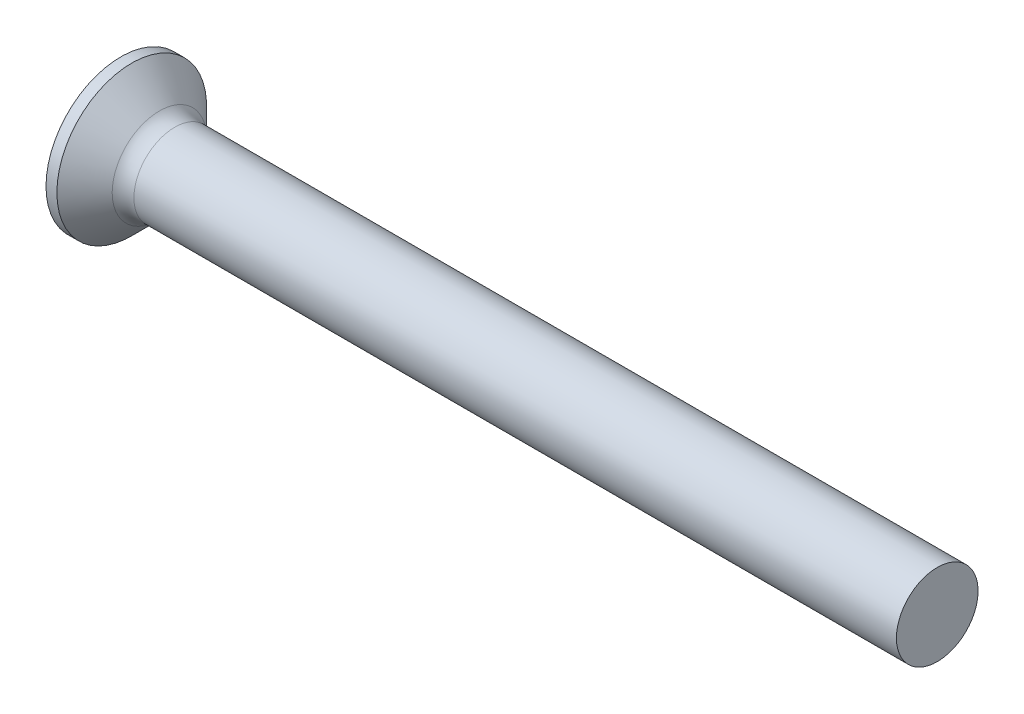
ISO-10303-21;
HEADER;
FILE_DESCRIPTION(('STEP AP214'),'2;1');
FILE_NAME('part.step','',(''),(''),'','','');
FILE_SCHEMA(('AUTOMOTIVE_DESIGN { 1 0 10303 214 1 1 1 1 }'));
ENDSEC;
DATA;
#1=APPLICATION_CONTEXT('core data for automotive mechanical design processes');
#2=APPLICATION_PROTOCOL_DEFINITION('international standard','automotive_design',2000,#1);
#3=PRODUCT_CONTEXT('',#1,'mechanical');
#4=PRODUCT('Part','Part','',(#3));
#5=PRODUCT_RELATED_PRODUCT_CATEGORY('part','',(#4));
#6=PRODUCT_DEFINITION_FORMATION('','',#4);
#7=PRODUCT_DEFINITION_CONTEXT('part definition',#1,'design');
#8=PRODUCT_DEFINITION('design','',#6,#7);
#9=PRODUCT_DEFINITION_SHAPE('','',#8);
#10=(LENGTH_UNIT() NAMED_UNIT(*) SI_UNIT(.MILLI.,.METRE.));
#11=(NAMED_UNIT(*) PLANE_ANGLE_UNIT() SI_UNIT($,.RADIAN.));
#12=(NAMED_UNIT(*) SI_UNIT($,.STERADIAN.) SOLID_ANGLE_UNIT());
#13=UNCERTAINTY_MEASURE_WITH_UNIT(LENGTH_MEASURE(1.E-05),#10,'distance_accuracy_value','');
#14=(GEOMETRIC_REPRESENTATION_CONTEXT(3) GLOBAL_UNCERTAINTY_ASSIGNED_CONTEXT((#13)) GLOBAL_UNIT_ASSIGNED_CONTEXT((#10,
#11,#12)) REPRESENTATION_CONTEXT('',''));
#15=CARTESIAN_POINT('',(0.,0.,0.));
#16=DIRECTION('',(0.,0.,1.));
#17=DIRECTION('',(1.,0.,0.));
#18=AXIS2_PLACEMENT_3D('',#15,#16,#17);
#19=CARTESIAN_POINT('',(2.01,0.370000000000002,-0.49785100239185));
#20=DIRECTION('',(-0.446197800778958,0.,0.89493436774996));
#21=DIRECTION('',(0.89493436774996,0.,0.446197800778958));
#22=AXIS2_PLACEMENT_3D('',#19,#20,#21);
#23=PLANE('',#22);
#24=DIRECTION('',(0.,1.,0.));
#25=VECTOR('',#24,1.);
#26=CARTESIAN_POINT('',(0.,0.370000000000002,-1.5));
#27=LINE('',#26,#25);
#28=CARTESIAN_POINT('',(0.,0.370000000000005,-1.5));
#29=VERTEX_POINT('',#28);
#30=CARTESIAN_POINT('',(0.,-0.369999999999995,-1.5));
#31=VERTEX_POINT('',#30);
#32=EDGE_CURVE('E174',#29,#31,#27,.F.);
#33=ORIENTED_EDGE('',*,*,#32,.T.);
#34=DIRECTION('',(-0.89493436774996,0.,-0.446197800778958));
#35=VECTOR('',#34,1.);
#36=CARTESIAN_POINT('',(2.01,-0.369999999999999,-0.497851002391852));
#37=LINE('',#36,#35);
#38=CARTESIAN_POINT('',(2.01,-0.369999999999998,-0.497851002391852));
#39=VERTEX_POINT('',#38);
#40=EDGE_CURVE('E202',#39,#31,#37,.T.);
#41=ORIENTED_EDGE('',*,*,#40,.F.);
#42=DIRECTION('',(0.,1.,0.));
#43=VECTOR('',#42,1.);
#44=CARTESIAN_POINT('',(2.01,0.370000000000002,-0.49785100239185));
#45=LINE('',#44,#43);
#46=CARTESIAN_POINT('',(2.00999999999998,-0.247548741500632,-0.497851002391852));
#47=VERTEX_POINT('',#46);
#48=EDGE_CURVE('E185',#39,#47,#45,.T.);
#49=ORIENTED_EDGE('',*,*,#48,.T.);
#50=CARTESIAN_POINT('',(2.86902882958261,0.,-0.0695550419526875));
#51=DIRECTION('',(-0.446197800778958,0.,0.89493436774996));
#52=DIRECTION('',(-0.89493436774996,0.,-0.446197800778958));
#53=AXIS2_PLACEMENT_3D('',#50,#51,#52);
#54=ELLIPSE('',#53,1.11145965244602,0.491029028343212);
#55=CARTESIAN_POINT('',(2.01,0.247548741500636,-0.497851002391851));
#56=VERTEX_POINT('',#55);
#57=EDGE_CURVE('E19',#47,#56,#54,.F.);
#58=ORIENTED_EDGE('',*,*,#57,.T.);
#59=DIRECTION('',(0.,1.,0.));
#60=VECTOR('',#59,1.);
#61=CARTESIAN_POINT('',(2.01,0.370000000000002,-0.49785100239185));
#62=LINE('',#61,#60);
#63=CARTESIAN_POINT('',(2.01,0.370000000000002,-0.49785100239185));
#64=VERTEX_POINT('',#63);
#65=EDGE_CURVE('E166',#56,#64,#62,.T.);
#66=ORIENTED_EDGE('',*,*,#65,.T.);
#67=DIRECTION('',(0.89493436774996,0.,0.446197800778958));
#68=VECTOR('',#67,1.);
#69=CARTESIAN_POINT('',(0.,0.370000000000005,-1.5));
#70=LINE('',#69,#68);
#71=EDGE_CURVE('E192',#29,#64,#70,.T.);
#72=ORIENTED_EDGE('',*,*,#71,.F.);
#73=EDGE_LOOP('',(#33,#41,#49,#58,#66,#72));
#74=FACE_BOUND('',#73,.T.);
#75=ADVANCED_FACE('F16',(#74),#23,.T.);
#76=CARTESIAN_POINT('',(2.01,-0.369999999999999,-0.497851002391852));
#77=DIRECTION('',(0.,1.,0.));
#78=DIRECTION('',(0.,0.,1.));
#79=AXIS2_PLACEMENT_3D('',#76,#77,#78);
#80=PLANE('',#79);
#81=DIRECTION('',(0.,0.,1.));
#82=VECTOR('',#81,1.);
#83=CARTESIAN_POINT('',(2.01,-0.369999999999999,-0.497851002391852));
#84=LINE('',#83,#82);
#85=CARTESIAN_POINT('',(2.00999999999215,-0.369999999999999,-0.415013252802522));
#86=VERTEX_POINT('',#85);
#87=EDGE_CURVE('E205',#86,#39,#84,.F.);
#88=ORIENTED_EDGE('',*,*,#87,.T.);
#89=ORIENTED_EDGE('',*,*,#40,.T.);
#90=DIRECTION('',(0.,0.,1.));
#91=VECTOR('',#90,1.);
#92=CARTESIAN_POINT('',(0.,-0.369999999999999,-0.497851002391852));
#93=LINE('',#92,#91);
#94=CARTESIAN_POINT('',(0.,-0.369999999999998,-0.590157547919396));
#95=VERTEX_POINT('',#94);
#96=EDGE_CURVE('E199',#31,#95,#93,.T.);
#97=ORIENTED_EDGE('',*,*,#96,.T.);
#98=CARTESIAN_POINT('',(1.8304273123974E-13,-0.369999999999998,-0.590157547919381));
#99=CARTESIAN_POINT('',(0.216309052140947,-0.369999999999998,-0.572289577009795));
#100=CARTESIAN_POINT('',(0.432602407240752,-0.369999999999998,-0.55422283720754));
#101=CARTESIAN_POINT('',(0.865134686024455,-0.369999999999999,-0.51747646673141));
#102=CARTESIAN_POINT('',(1.08137361024975,-0.369999999999999,-0.498796842417631));
#103=CARTESIAN_POINT('',(1.41633940967486,-0.369999999999999,-0.469214323587316));
#104=CARTESIAN_POINT('',(1.53509176406674,-0.369999999999999,-0.458600717042247));
#105=CARTESIAN_POINT('',(1.77256859362964,-0.369999999999999,-0.437058976884605));
#106=CARTESIAN_POINT('',(1.89129306863835,-0.369999999999999,-0.426130841484444));
#107=CARTESIAN_POINT('',(2.00999999999512,-0.369999999999999,-0.41501325280501));
#108=B_SPLINE_CURVE_WITH_KNOTS('',3,(#98,#99,#100,#101,#102,#103,#104,#105,#106,#107),
.UNSPECIFIED.,.F.,.F.,(4,2,2,2,4),(0.,0.651138391205932,1.30227002747919,1.65994677859564,
2.01762556292617),.UNSPECIFIED.);
#109=EDGE_CURVE('E445',#95,#86,#108,.T.);
#110=ORIENTED_EDGE('',*,*,#109,.T.);
#111=EDGE_LOOP('',(#88,#89,#97,#110));
#112=FACE_BOUND('',#111,.T.);
#113=ADVANCED_FACE('F463',(#112),#80,.T.);
#114=CARTESIAN_POINT('',(2.01,0.369999999999998,0.497851002391852));
#115=DIRECTION('',(0.,-1.,0.));
#116=DIRECTION('',(0.,0.,-1.));
#117=AXIS2_PLACEMENT_3D('',#114,#115,#116);
#118=PLANE('',#117);
#119=DIRECTION('',(0.,0.,-1.));
#120=VECTOR('',#119,1.);
#121=CARTESIAN_POINT('',(0.,0.369999999999998,0.497851002391852));
#122=LINE('',#121,#120);
#123=CARTESIAN_POINT('',(0.,0.370000000000001,-0.590157547919387));
#124=VERTEX_POINT('',#123);
#125=EDGE_CURVE('E195',#124,#29,#122,.T.);
#126=ORIENTED_EDGE('',*,*,#125,.T.);
#127=ORIENTED_EDGE('',*,*,#71,.T.);
#128=DIRECTION('',(0.,0.,-1.));
#129=VECTOR('',#128,1.);
#130=CARTESIAN_POINT('',(2.01,0.369999999999998,0.497851002391852));
#131=LINE('',#130,#129);
#132=CARTESIAN_POINT('',(2.00999999999215,0.370000000000002,-0.41501325280252));
#133=VERTEX_POINT('',#132);
#134=EDGE_CURVE('E170',#64,#133,#131,.F.);
#135=ORIENTED_EDGE('',*,*,#134,.T.);
#136=CARTESIAN_POINT('',(2.00999999999499,0.370000000000002,-0.415013252803601));
#137=CARTESIAN_POINT('',(1.83750309020829,0.370000000000002,-0.431158569065824));
#138=CARTESIAN_POINT('',(1.66497088180432,0.370000000000002,-0.446919712843423));
#139=CARTESIAN_POINT('',(1.31985329581661,0.370000000000002,-0.477835113087158));
#140=CARTESIAN_POINT('',(1.14726791863695,0.370000000000002,-0.492989374056398));
#141=CARTESIAN_POINT('',(0.812249302666097,0.370000000000002,-0.521971147103273));
#142=CARTESIAN_POINT('',(0.649818258439769,0.370000000000001,-0.535824167251821));
#143=CARTESIAN_POINT('',(0.324928129773506,0.370000000000001,-0.563211285368423));
#144=CARTESIAN_POINT('',(0.162469045147424,0.370000000000001,-0.576745381130288));
#145=CARTESIAN_POINT('',(2.04026034606491E-13,0.370000000000001,-0.590157547919622));
#146=B_SPLINE_CURVE_WITH_KNOTS('',3,(#136,#137,#138,#139,#140,#141,#142,#143,#144,#145),
.UNSPECIFIED.,.F.,.F.,(4,2,2,2,4),(0.,0.519751169069005,1.03949848084209,1.52856030580364,
2.01762551290344),.UNSPECIFIED.);
#147=EDGE_CURVE('E442',#133,#124,#146,.T.);
#148=ORIENTED_EDGE('',*,*,#147,.T.);
#149=EDGE_LOOP('',(#126,#127,#135,#148));
#150=FACE_BOUND('',#149,.T.);
#151=ADVANCED_FACE('F486',(#150),#118,.T.);
#152=CARTESIAN_POINT('',(0.,0.,0.));
#153=DIRECTION('',(-1.,0.,0.));
#154=DIRECTION('',(0.,0.,1.));
#155=AXIS2_PLACEMENT_3D('',#152,#153,#154);
#156=CONICAL_SURFACE('',#155,0.696552892009095,0.0698131700800835);
#157=ORIENTED_EDGE('',*,*,#109,.F.);
#158=CARTESIAN_POINT('',(0.,0.,0.));
#159=DIRECTION('',(-1.,0.,0.));
#160=DIRECTION('',(0.,0.,1.));
#161=AXIS2_PLACEMENT_3D('',#158,#159,#160);
#162=CIRCLE('',#161,0.696552892009095);
#163=CARTESIAN_POINT('',(0.,-0.590157547919396,-0.369999999999999));
#164=VERTEX_POINT('',#163);
#165=EDGE_CURVE('E194',#164,#95,#162,.F.);
#166=ORIENTED_EDGE('',*,*,#165,.F.);
#167=CARTESIAN_POINT('',(2.00999999999762,-0.415013252803356,-0.37));
#168=CARTESIAN_POINT('',(1.83750309021098,-0.431158569065578,-0.37));
#169=CARTESIAN_POINT('',(1.66497088180707,-0.446919712843175,-0.37));
#170=CARTESIAN_POINT('',(1.31985329581947,-0.477835113086907,-0.37));
#171=CARTESIAN_POINT('',(1.14726791863987,-0.492989374056144,-0.37));
#172=CARTESIAN_POINT('',(0.812249302668581,-0.521971147103062,-0.37));
#173=CARTESIAN_POINT('',(0.649818258441765,-0.535824167251653,-0.37));
#174=CARTESIAN_POINT('',(0.324928129774522,-0.563211285368339,-0.37));
#175=CARTESIAN_POINT('',(0.162469045147951,-0.576745381130245,-0.369999999999999));
#176=CARTESIAN_POINT('',(2.40997336507689E-13,-0.59015754791962,-0.369999999999999));
#177=B_SPLINE_CURVE_WITH_KNOTS('',3,(#167,#168,#169,#170,#171,#172,#173,#174,#175,#176),
.UNSPECIFIED.,.F.,.F.,(4,2,2,2,4),(0.,0.519751169068833,1.03949848084174,1.52856030580477,
2.01762551290604),.UNSPECIFIED.);
#178=CARTESIAN_POINT('',(2.00999999999215,-0.415013252802521,-0.37));
#179=VERTEX_POINT('',#178);
#180=EDGE_CURVE('E432',#179,#164,#177,.T.);
#181=ORIENTED_EDGE('',*,*,#180,.F.);
#182=CARTESIAN_POINT('',(2.0099999999843,0.,0.));
#183=DIRECTION('',(-1.,0.,0.));
#184=DIRECTION('',(0.,0.,1.));
#185=AXIS2_PLACEMENT_3D('',#182,#183,#184);
#186=CIRCLE('',#185,0.55600000000311);
#187=EDGE_CURVE('E443',#86,#179,#186,.T.);
#188=ORIENTED_EDGE('',*,*,#187,.F.);
#189=EDGE_LOOP('',(#157,#166,#181,#188));
#190=FACE_BOUND('',#189,.T.);
#191=ADVANCED_FACE('F466',(#190),#156,.F.);
#192=CARTESIAN_POINT('',(0.,0.,0.));
#193=DIRECTION('',(-1.,0.,0.));
#194=DIRECTION('',(0.,0.,1.));
#195=AXIS2_PLACEMENT_3D('',#192,#193,#194);
#196=CONICAL_SURFACE('',#195,0.696552892009095,0.0698131700800835);
#197=ORIENTED_EDGE('',*,*,#147,.F.);
#198=CARTESIAN_POINT('',(2.0099999999843,0.,0.));
#199=DIRECTION('',(-1.,0.,0.));
#200=DIRECTION('',(0.,0.,1.));
#201=AXIS2_PLACEMENT_3D('',#198,#199,#200);
#202=CIRCLE('',#201,0.55600000000311);
#203=CARTESIAN_POINT('',(2.00999999999215,0.415013252802521,-0.37));
#204=VERTEX_POINT('',#203);
#205=EDGE_CURVE('E178',#204,#133,#202,.T.);
#206=ORIENTED_EDGE('',*,*,#205,.F.);
#207=CARTESIAN_POINT('',(2.19921746085999E-13,0.590157547919377,-0.369999999999999));
#208=CARTESIAN_POINT('',(0.216309052140984,0.572289577009791,-0.369999999999999));
#209=CARTESIAN_POINT('',(0.432602407240787,0.554222837207536,-0.37));
#210=CARTESIAN_POINT('',(0.865134686024488,0.517476466731406,-0.37));
#211=CARTESIAN_POINT('',(1.08137361024978,0.498796842417628,-0.37));
#212=CARTESIAN_POINT('',(1.41633940967533,0.469214323587274,-0.37));
#213=CARTESIAN_POINT('',(1.53509176406764,0.458600717042166,-0.37));
#214=CARTESIAN_POINT('',(1.77256859363141,0.437058976884443,-0.37));
#215=CARTESIAN_POINT('',(1.89129306864055,0.426130841484241,-0.37));
#216=CARTESIAN_POINT('',(2.00999999999775,0.415013252804763,-0.37));
#217=B_SPLINE_CURVE_WITH_KNOTS('',3,(#207,#208,#209,#210,#211,#212,#213,#214,#215,#216),
.UNSPECIFIED.,.F.,.F.,(4,2,2,2,4),(0.,0.65113839120593,1.30227002747919,1.65994677859694,
2.01762556292877),.UNSPECIFIED.);
#218=CARTESIAN_POINT('',(1.09961796321834E-13,0.590157547919387,-0.369999999999999));
#219=VERTEX_POINT('',#218);
#220=EDGE_CURVE('E422',#219,#204,#217,.T.);
#221=ORIENTED_EDGE('',*,*,#220,.F.);
#222=CARTESIAN_POINT('',(0.,0.,0.));
#223=DIRECTION('',(-1.,0.,0.));
#224=DIRECTION('',(0.,0.,1.));
#225=AXIS2_PLACEMENT_3D('',#222,#223,#224);
#226=CIRCLE('',#225,0.696552892009095);
#227=EDGE_CURVE('E438',#124,#219,#226,.F.);
#228=ORIENTED_EDGE('',*,*,#227,.F.);
#229=EDGE_LOOP('',(#197,#206,#221,#228));
#230=FACE_BOUND('',#229,.T.);
#231=ADVANCED_FACE('F493',(#230),#196,.F.);
#232=CARTESIAN_POINT('',(2.01,0.497851002391851,-0.37));
#233=DIRECTION('',(0.,0.,1.));
#234=DIRECTION('',(1.,0.,0.));
#235=AXIS2_PLACEMENT_3D('',#232,#233,#234);
#236=PLANE('',#235);
#237=DIRECTION('',(0.,1.,0.));
#238=VECTOR('',#237,1.);
#239=CARTESIAN_POINT('',(0.,0.497851002391851,-0.369999999999999));
#240=LINE('',#239,#238);
#241=CARTESIAN_POINT('',(0.,-1.5,-0.37));
#242=VERTEX_POINT('',#241);
#243=EDGE_CURVE('E428',#164,#242,#240,.F.);
#244=ORIENTED_EDGE('',*,*,#243,.T.);
#245=DIRECTION('',(-0.89493436774996,-0.446197800778958,0.));
#246=VECTOR('',#245,1.);
#247=CARTESIAN_POINT('',(2.01,-0.497851002391851,-0.37));
#248=LINE('',#247,#246);
#249=CARTESIAN_POINT('',(2.01,-0.497851002391851,-0.37));
#250=VERTEX_POINT('',#249);
#251=EDGE_CURVE('E409',#250,#242,#248,.T.);
#252=ORIENTED_EDGE('',*,*,#251,.F.);
#253=DIRECTION('',(0.,1.,0.));
#254=VECTOR('',#253,1.);
#255=CARTESIAN_POINT('',(2.01,0.497851002391851,-0.37));
#256=LINE('',#255,#254);
#257=EDGE_CURVE('E435',#250,#179,#256,.T.);
#258=ORIENTED_EDGE('',*,*,#257,.T.);
#259=ORIENTED_EDGE('',*,*,#180,.T.);
#260=EDGE_LOOP('',(#244,#252,#258,#259));
#261=FACE_BOUND('',#260,.T.);
#262=ADVANCED_FACE('F538',(#261),#236,.T.);
#263=CARTESIAN_POINT('',(2.01,0.497851002391851,-0.37));
#264=DIRECTION('',(0.,0.,1.));
#265=DIRECTION('',(1.,0.,0.));
#266=AXIS2_PLACEMENT_3D('',#263,#264,#265);
#267=PLANE('',#266);
#268=DIRECTION('',(0.,1.,0.));
#269=VECTOR('',#268,1.);
#270=CARTESIAN_POINT('',(2.01,0.497851002391851,-0.37));
#271=LINE('',#270,#269);
#272=CARTESIAN_POINT('',(2.01,0.497851002391851,-0.37));
#273=VERTEX_POINT('',#272);
#274=EDGE_CURVE('E414',#204,#273,#271,.T.);
#275=ORIENTED_EDGE('',*,*,#274,.T.);
#276=DIRECTION('',(0.89493436774996,-0.446197800778958,0.));
#277=VECTOR('',#276,1.);
#278=CARTESIAN_POINT('',(2.01,0.497851002391851,-0.37));
#279=LINE('',#278,#277);
#280=CARTESIAN_POINT('',(0.,1.5,-0.37));
#281=VERTEX_POINT('',#280);
#282=EDGE_CURVE('E390',#281,#273,#279,.T.);
#283=ORIENTED_EDGE('',*,*,#282,.F.);
#284=DIRECTION('',(0.,1.,0.));
#285=VECTOR('',#284,1.);
#286=CARTESIAN_POINT('',(0.,0.497851002391851,-0.369999999999999));
#287=LINE('',#286,#285);
#288=EDGE_CURVE('E425',#281,#219,#287,.F.);
#289=ORIENTED_EDGE('',*,*,#288,.T.);
#290=ORIENTED_EDGE('',*,*,#220,.T.);
#291=EDGE_LOOP('',(#275,#283,#289,#290));
#292=FACE_BOUND('',#291,.T.);
#293=ADVANCED_FACE('F533',(#292),#267,.T.);
#294=CARTESIAN_POINT('',(2.01,-0.497851002391851,-0.37));
#295=DIRECTION('',(-0.446197800778958,0.89493436774996,0.));
#296=DIRECTION('',(-0.89493436774996,-0.446197800778958,0.));
#297=AXIS2_PLACEMENT_3D('',#294,#295,#296);
#298=PLANE('',#297);
#299=DIRECTION('',(0.,0.,1.));
#300=VECTOR('',#299,1.);
#301=CARTESIAN_POINT('',(0.,-1.5,-0.37));
#302=LINE('',#301,#300);
#303=CARTESIAN_POINT('',(0.,-1.5,0.37));
#304=VERTEX_POINT('',#303);
#305=EDGE_CURVE('E400',#242,#304,#302,.T.);
#306=ORIENTED_EDGE('',*,*,#305,.T.);
#307=DIRECTION('',(-0.89493436774996,-0.446197800778958,0.));
#308=VECTOR('',#307,1.);
#309=CARTESIAN_POINT('',(2.01,-0.497851002391851,0.37));
#310=LINE('',#309,#308);
#311=CARTESIAN_POINT('',(2.01,-0.497851002391851,0.37));
#312=VERTEX_POINT('',#311);
#313=EDGE_CURVE('E350',#312,#304,#310,.T.);
#314=ORIENTED_EDGE('',*,*,#313,.F.);
#315=DIRECTION('',(0.,0.,-1.));
#316=VECTOR('',#315,1.);
#317=CARTESIAN_POINT('',(2.01,-0.497851002391851,-0.37));
#318=LINE('',#317,#316);
#319=CARTESIAN_POINT('',(2.01,-0.497851002391851,0.247548741500634));
#320=VERTEX_POINT('',#319);
#321=EDGE_CURVE('E375',#312,#320,#318,.T.);
#322=ORIENTED_EDGE('',*,*,#321,.T.);
#323=CARTESIAN_POINT('',(2.86902882958261,-0.0695550419526873,0.));
#324=DIRECTION('',(-0.446197800778958,0.89493436774996,0.));
#325=DIRECTION('',(-0.89493436774996,-0.446197800778958,0.));
#326=AXIS2_PLACEMENT_3D('',#323,#324,#325);
#327=ELLIPSE('',#326,1.11145965244602,0.491029028343212);
#328=CARTESIAN_POINT('',(2.00999999999998,-0.497851002391852,-0.247548741500634));
#329=VERTEX_POINT('',#328);
#330=EDGE_CURVE('E367',#320,#329,#327,.F.);
#331=ORIENTED_EDGE('',*,*,#330,.T.);
#332=DIRECTION('',(0.,0.,-1.));
#333=VECTOR('',#332,1.);
#334=CARTESIAN_POINT('',(2.01,-0.497851002391851,-0.37));
#335=LINE('',#334,#333);
#336=EDGE_CURVE('E360',#329,#250,#335,.T.);
#337=ORIENTED_EDGE('',*,*,#336,.T.);
#338=ORIENTED_EDGE('',*,*,#251,.T.);
#339=EDGE_LOOP('',(#306,#314,#322,#331,#337,#338));
#340=FACE_BOUND('',#339,.T.);
#341=ADVANCED_FACE('F537',(#340),#298,.T.);
#342=CARTESIAN_POINT('',(2.01,0.497851002391851,0.37));
#343=DIRECTION('',(-0.446197800778958,-0.89493436774996,0.));
#344=DIRECTION('',(0.89493436774996,-0.446197800778958,0.));
#345=AXIS2_PLACEMENT_3D('',#342,#343,#344);
#346=PLANE('',#345);
#347=DIRECTION('',(0.,0.,1.));
#348=VECTOR('',#347,1.);
#349=CARTESIAN_POINT('',(0.,1.5,0.37));
#350=LINE('',#349,#348);
#351=CARTESIAN_POINT('',(0.,1.5,0.37));
#352=VERTEX_POINT('',#351);
#353=EDGE_CURVE('E397',#352,#281,#350,.F.);
#354=ORIENTED_EDGE('',*,*,#353,.T.);
#355=ORIENTED_EDGE('',*,*,#282,.T.);
#356=DIRECTION('',(0.,0.,-1.));
#357=VECTOR('',#356,1.);
#358=CARTESIAN_POINT('',(2.01,0.497851002391851,-0.37));
#359=LINE('',#358,#357);
#360=CARTESIAN_POINT('',(2.01,0.497851002391851,-0.247548741500634));
#361=VERTEX_POINT('',#360);
#362=EDGE_CURVE('E388',#273,#361,#359,.F.);
#363=ORIENTED_EDGE('',*,*,#362,.T.);
#364=CARTESIAN_POINT('',(2.86902882958261,0.0695550419526879,0.));
#365=DIRECTION('',(-0.446197800778958,-0.89493436774996,0.));
#366=DIRECTION('',(-0.89493436774996,0.446197800778958,0.));
#367=AXIS2_PLACEMENT_3D('',#364,#365,#366);
#368=ELLIPSE('',#367,1.11145965244602,0.491029028343212);
#369=CARTESIAN_POINT('',(2.00999999999998,0.497851002391852,0.247548741500634));
#370=VERTEX_POINT('',#369);
#371=EDGE_CURVE('E381',#361,#370,#368,.F.);
#372=ORIENTED_EDGE('',*,*,#371,.T.);
#373=DIRECTION('',(0.,0.,-1.));
#374=VECTOR('',#373,1.);
#375=CARTESIAN_POINT('',(2.01,0.497851002391851,-0.37));
#376=LINE('',#375,#374);
#377=CARTESIAN_POINT('',(2.01,0.497851002391851,0.37));
#378=VERTEX_POINT('',#377);
#379=EDGE_CURVE('E377',#370,#378,#376,.F.);
#380=ORIENTED_EDGE('',*,*,#379,.T.);
#381=DIRECTION('',(0.89493436774996,-0.446197800778958,0.));
#382=VECTOR('',#381,1.);
#383=CARTESIAN_POINT('',(0.,1.5,0.37));
#384=LINE('',#383,#382);
#385=EDGE_CURVE('E180',#352,#378,#384,.T.);
#386=ORIENTED_EDGE('',*,*,#385,.F.);
#387=EDGE_LOOP('',(#354,#355,#363,#372,#380,#386));
#388=FACE_BOUND('',#387,.T.);
#389=ADVANCED_FACE('F589',(#388),#346,.T.);
#390=CARTESIAN_POINT('',(2.01,0.497851002391851,-0.37));
#391=DIRECTION('',(1.,0.,0.));
#392=DIRECTION('',(0.,0.,-1.));
#393=AXIS2_PLACEMENT_3D('',#390,#391,#392);
#394=PLANE('',#393);
#395=ORIENTED_EDGE('',*,*,#134,.F.);
#396=ORIENTED_EDGE('',*,*,#65,.F.);
#397=CARTESIAN_POINT('',(2.01,0.,0.));
#398=DIRECTION('',(-1.,0.,0.));
#399=DIRECTION('',(0.,0.,1.));
#400=AXIS2_PLACEMENT_3D('',#397,#398,#399);
#401=CIRCLE('',#400,0.556000000000001);
#402=EDGE_CURVE('E168',#56,#133,#401,.F.);
#403=ORIENTED_EDGE('',*,*,#402,.T.);
#404=EDGE_LOOP('',(#395,#396,#403));
#405=FACE_BOUND('',#404,.T.);
#406=ADVANCED_FACE('F167',(#405),#394,.F.);
#407=CARTESIAN_POINT('',(2.01,0.497851002391851,-0.37));
#408=DIRECTION('',(1.,0.,0.));
#409=DIRECTION('',(0.,0.,-1.));
#410=AXIS2_PLACEMENT_3D('',#407,#408,#409);
#411=PLANE('',#410);
#412=ORIENTED_EDGE('',*,*,#362,.F.);
#413=ORIENTED_EDGE('',*,*,#274,.F.);
#414=CARTESIAN_POINT('',(2.01,0.,0.));
#415=DIRECTION('',(-1.,0.,0.));
#416=DIRECTION('',(0.,0.,1.));
#417=AXIS2_PLACEMENT_3D('',#414,#415,#416);
#418=CIRCLE('',#417,0.556000000000001);
#419=EDGE_CURVE('E179',#204,#361,#418,.F.);
#420=ORIENTED_EDGE('',*,*,#419,.T.);
#421=EDGE_LOOP('',(#412,#413,#420));
#422=FACE_BOUND('',#421,.T.);
#423=ADVANCED_FACE('F583',(#422),#411,.F.);
#424=CARTESIAN_POINT('',(1.87352457248835,0.,0.));
#425=DIRECTION('',(-1.,0.,0.));
#426=DIRECTION('',(0.,-1.,0.));
#427=AXIS2_PLACEMENT_3D('',#424,#425,#426);
#428=CONICAL_SURFACE('',#427,0.565543291557447,0.069813170086462);
#429=ORIENTED_EDGE('',*,*,#371,.F.);
#430=CARTESIAN_POINT('',(2.00999999999996,0.,0.));
#431=DIRECTION('',(-1.,0.,0.));
#432=DIRECTION('',(0.,0.,1.));
#433=AXIS2_PLACEMENT_3D('',#430,#431,#432);
#434=CIRCLE('',#433,0.556000000000001);
#435=EDGE_CURVE('E384',#361,#370,#434,.F.);
#436=ORIENTED_EDGE('',*,*,#435,.T.);
#437=EDGE_LOOP('',(#429,#436));
#438=FACE_BOUND('',#437,.T.);
#439=ADVANCED_FACE('F579',(#438),#428,.F.);
#440=CARTESIAN_POINT('',(2.01,0.497851002391851,-0.37));
#441=DIRECTION('',(1.,0.,0.));
#442=DIRECTION('',(0.,0.,-1.));
#443=AXIS2_PLACEMENT_3D('',#440,#441,#442);
#444=PLANE('',#443);
#445=DIRECTION('',(0.,1.,0.));
#446=VECTOR('',#445,1.);
#447=CARTESIAN_POINT('',(2.01,-0.497851002391851,0.37));
#448=LINE('',#447,#446);
#449=CARTESIAN_POINT('',(2.00999999999215,0.415013252802521,0.370000000000001));
#450=VERTEX_POINT('',#449);
#451=EDGE_CURVE('E345',#378,#450,#448,.F.);
#452=ORIENTED_EDGE('',*,*,#451,.F.);
#453=ORIENTED_EDGE('',*,*,#379,.F.);
#454=CARTESIAN_POINT('',(2.01,0.,0.));
#455=DIRECTION('',(-1.,0.,0.));
#456=DIRECTION('',(0.,0.,1.));
#457=AXIS2_PLACEMENT_3D('',#454,#455,#456);
#458=CIRCLE('',#457,0.556000000000001);
#459=EDGE_CURVE('E387',#370,#450,#458,.F.);
#460=ORIENTED_EDGE('',*,*,#459,.T.);
#461=EDGE_LOOP('',(#452,#453,#460));
#462=FACE_BOUND('',#461,.T.);
#463=ADVANCED_FACE('F572',(#462),#444,.F.);
#464=CARTESIAN_POINT('',(2.01,0.497851002391851,-0.37));
#465=DIRECTION('',(1.,0.,0.));
#466=DIRECTION('',(0.,0.,-1.));
#467=AXIS2_PLACEMENT_3D('',#464,#465,#466);
#468=PLANE('',#467);
#469=ORIENTED_EDGE('',*,*,#321,.F.);
#470=DIRECTION('',(0.,1.,0.));
#471=VECTOR('',#470,1.);
#472=CARTESIAN_POINT('',(2.01,-0.497851002391851,0.37));
#473=LINE('',#472,#471);
#474=CARTESIAN_POINT('',(2.00999999999215,-0.415013252802521,0.370000000000001));
#475=VERTEX_POINT('',#474);
#476=EDGE_CURVE('E353',#475,#312,#473,.F.);
#477=ORIENTED_EDGE('',*,*,#476,.F.);
#478=CARTESIAN_POINT('',(2.01,0.,0.));
#479=DIRECTION('',(-1.,0.,0.));
#480=DIRECTION('',(0.,0.,1.));
#481=AXIS2_PLACEMENT_3D('',#478,#479,#480);
#482=CIRCLE('',#481,0.556000000000001);
#483=EDGE_CURVE('E374',#475,#320,#482,.F.);
#484=ORIENTED_EDGE('',*,*,#483,.T.);
#485=EDGE_LOOP('',(#469,#477,#484));
#486=FACE_BOUND('',#485,.T.);
#487=ADVANCED_FACE('F565',(#486),#468,.F.);
#488=CARTESIAN_POINT('',(1.87352457248835,0.,0.));
#489=DIRECTION('',(-1.,0.,0.));
#490=DIRECTION('',(0.,-1.,0.));
#491=AXIS2_PLACEMENT_3D('',#488,#489,#490);
#492=CONICAL_SURFACE('',#491,0.565543291557447,0.069813170086462);
#493=ORIENTED_EDGE('',*,*,#330,.F.);
#494=CARTESIAN_POINT('',(2.00999999999996,0.,0.));
#495=DIRECTION('',(-1.,0.,0.));
#496=DIRECTION('',(0.,0.,1.));
#497=AXIS2_PLACEMENT_3D('',#494,#495,#496);
#498=CIRCLE('',#497,0.556000000000001);
#499=EDGE_CURVE('E370',#320,#329,#498,.F.);
#500=ORIENTED_EDGE('',*,*,#499,.T.);
#501=EDGE_LOOP('',(#493,#500));
#502=FACE_BOUND('',#501,.T.);
#503=ADVANCED_FACE('F563',(#502),#492,.F.);
#504=CARTESIAN_POINT('',(2.01,0.497851002391851,-0.37));
#505=DIRECTION('',(1.,0.,0.));
#506=DIRECTION('',(0.,0.,-1.));
#507=AXIS2_PLACEMENT_3D('',#504,#505,#506);
#508=PLANE('',#507);
#509=ORIENTED_EDGE('',*,*,#257,.F.);
#510=ORIENTED_EDGE('',*,*,#336,.F.);
#511=CARTESIAN_POINT('',(2.01,0.,0.));
#512=DIRECTION('',(-1.,0.,0.));
#513=DIRECTION('',(0.,0.,1.));
#514=AXIS2_PLACEMENT_3D('',#511,#512,#513);
#515=CIRCLE('',#514,0.556000000000001);
#516=EDGE_CURVE('E373',#329,#179,#515,.F.);
#517=ORIENTED_EDGE('',*,*,#516,.T.);
#518=EDGE_LOOP('',(#509,#510,#517));
#519=FACE_BOUND('',#518,.T.);
#520=ADVANCED_FACE('F558',(#519),#508,.F.);
#521=CARTESIAN_POINT('',(2.01,0.497851002391851,-0.37));
#522=DIRECTION('',(1.,0.,0.));
#523=DIRECTION('',(0.,0.,-1.));
#524=AXIS2_PLACEMENT_3D('',#521,#522,#523);
#525=PLANE('',#524);
#526=ORIENTED_EDGE('',*,*,#48,.F.);
#527=ORIENTED_EDGE('',*,*,#87,.F.);
#528=CARTESIAN_POINT('',(2.01,0.,0.));
#529=DIRECTION('',(-1.,0.,0.));
#530=DIRECTION('',(0.,0.,1.));
#531=AXIS2_PLACEMENT_3D('',#528,#529,#530);
#532=CIRCLE('',#531,0.556000000000001);
#533=EDGE_CURVE('E161',#86,#47,#532,.F.);
#534=ORIENTED_EDGE('',*,*,#533,.T.);
#535=EDGE_LOOP('',(#526,#527,#534));
#536=FACE_BOUND('',#535,.T.);
#537=ADVANCED_FACE('F501',(#536),#525,.F.);
#538=CARTESIAN_POINT('',(1.87352457248835,0.,0.));
#539=DIRECTION('',(-1.,0.,0.));
#540=DIRECTION('',(0.,-1.,0.));
#541=AXIS2_PLACEMENT_3D('',#538,#539,#540);
#542=CONICAL_SURFACE('',#541,0.565543291557447,0.069813170086462);
#543=ORIENTED_EDGE('',*,*,#57,.F.);
#544=CARTESIAN_POINT('',(2.00999999999996,0.,0.));
#545=DIRECTION('',(-1.,0.,0.));
#546=DIRECTION('',(0.,0.,1.));
#547=AXIS2_PLACEMENT_3D('',#544,#545,#546);
#548=CIRCLE('',#547,0.556000000000001);
#549=EDGE_CURVE('E153',#47,#56,#548,.F.);
#550=ORIENTED_EDGE('',*,*,#549,.T.);
#551=EDGE_LOOP('',(#543,#550));
#552=FACE_BOUND('',#551,.T.);
#553=ADVANCED_FACE('F155',(#552),#542,.F.);
#554=CARTESIAN_POINT('',(2.01,-0.497851002391851,0.37));
#555=DIRECTION('',(0.,0.,-1.));
#556=DIRECTION('',(-1.,0.,0.));
#557=AXIS2_PLACEMENT_3D('',#554,#555,#556);
#558=PLANE('',#557);
#559=ORIENTED_EDGE('',*,*,#476,.T.);
#560=ORIENTED_EDGE('',*,*,#313,.T.);
#561=DIRECTION('',(0.,1.,0.));
#562=VECTOR('',#561,1.);
#563=CARTESIAN_POINT('',(0.,-0.497851002391851,0.37));
#564=LINE('',#563,#562);
#565=CARTESIAN_POINT('',(0.,-0.590157547919395,0.37));
#566=VERTEX_POINT('',#565);
#567=EDGE_CURVE('E356',#304,#566,#564,.T.);
#568=ORIENTED_EDGE('',*,*,#567,.T.);
#569=CARTESIAN_POINT('',(1.83048456276235E-13,-0.59015754791938,0.37));
#570=CARTESIAN_POINT('',(0.216309052140947,-0.572289577009794,0.37));
#571=CARTESIAN_POINT('',(0.432602407240752,-0.554222837207539,0.37));
#572=CARTESIAN_POINT('',(0.865134686024455,-0.517476466731409,0.37));
#573=CARTESIAN_POINT('',(1.08137361024975,-0.49879684241763,0.37));
#574=CARTESIAN_POINT('',(1.41633940967486,-0.469214323587315,0.37));
#575=CARTESIAN_POINT('',(1.53509176406674,-0.458600717042246,0.37));
#576=CARTESIAN_POINT('',(1.77256859362964,-0.437058976884604,0.37));
#577=CARTESIAN_POINT('',(1.89129306863835,-0.426130841484443,0.37));
#578=CARTESIAN_POINT('',(2.00999999999512,-0.415013252805009,0.37));
#579=B_SPLINE_CURVE_WITH_KNOTS('',3,(#569,#570,#571,#572,#573,#574,#575,#576,#577,#578),
.UNSPECIFIED.,.F.,.F.,(4,2,2,2,4),(0.,0.651138391205932,1.30227002747919,1.65994677859564,
2.01762556292617),.UNSPECIFIED.);
#580=EDGE_CURVE('E160',#566,#475,#579,.T.);
#581=ORIENTED_EDGE('',*,*,#580,.T.);
#582=EDGE_LOOP('',(#559,#560,#568,#581));
#583=FACE_BOUND('',#582,.T.);
#584=ADVANCED_FACE('F623',(#583),#558,.T.);
#585=CARTESIAN_POINT('',(2.01,-0.497851002391851,0.37));
#586=DIRECTION('',(0.,0.,-1.));
#587=DIRECTION('',(-1.,0.,0.));
#588=AXIS2_PLACEMENT_3D('',#585,#586,#587);
#589=PLANE('',#588);
#590=DIRECTION('',(0.,1.,0.));
#591=VECTOR('',#590,1.);
#592=CARTESIAN_POINT('',(0.,-0.497851002391851,0.37));
#593=LINE('',#592,#591);
#594=CARTESIAN_POINT('',(0.,0.590157547919388,0.37));
#595=VERTEX_POINT('',#594);
#596=EDGE_CURVE('E342',#595,#352,#593,.T.);
#597=ORIENTED_EDGE('',*,*,#596,.T.);
#598=ORIENTED_EDGE('',*,*,#385,.T.);
#599=ORIENTED_EDGE('',*,*,#451,.T.);
#600=CARTESIAN_POINT('',(2.00999999999499,0.415013252803602,0.37));
#601=CARTESIAN_POINT('',(1.83750309020829,0.431158569065825,0.37));
#602=CARTESIAN_POINT('',(1.66497088180432,0.446919712843424,0.37));
#603=CARTESIAN_POINT('',(1.31985329581661,0.477835113087159,0.37));
#604=CARTESIAN_POINT('',(1.14726791863695,0.492989374056399,0.37));
#605=CARTESIAN_POINT('',(0.812249302666097,0.521971147103274,0.37));
#606=CARTESIAN_POINT('',(0.649818258439769,0.535824167251822,0.37));
#607=CARTESIAN_POINT('',(0.324928129773506,0.563211285368424,0.37));
#608=CARTESIAN_POINT('',(0.162469045147424,0.576745381130288,0.37));
#609=CARTESIAN_POINT('',(2.04035084014091E-13,0.590157547919622,0.37));
#610=B_SPLINE_CURVE_WITH_KNOTS('',3,(#600,#601,#602,#603,#604,#605,#606,#607,#608,#609),
.UNSPECIFIED.,.F.,.F.,(4,2,2,2,4),(0.,0.519751169069005,1.03949848084209,1.52856030580364,
2.01762551290344),.UNSPECIFIED.);
#611=EDGE_CURVE('E608',#450,#595,#610,.T.);
#612=ORIENTED_EDGE('',*,*,#611,.T.);
#613=EDGE_LOOP('',(#597,#598,#599,#612));
#614=FACE_BOUND('',#613,.T.);
#615=ADVANCED_FACE('F606',(#614),#589,.T.);
#616=CARTESIAN_POINT('',(2.01000000000029,0.,0.));
#617=DIRECTION('',(-1.,0.,0.));
#618=DIRECTION('',(0.,0.,1.));
#619=AXIS2_PLACEMENT_3D('',#616,#617,#618);
#620=CONICAL_SURFACE('',#619,0.555999999999113,1.25663706143445);
#621=CARTESIAN_POINT('',(2.19065535110557,0.,4.44089209850063E-13));
#622=VERTEX_POINT('',#621);
#623=VERTEX_LOOP('',#622);
#624=FACE_BOUND('',#623,.T.);
#625=ORIENTED_EDGE('',*,*,#402,.F.);
#626=ORIENTED_EDGE('',*,*,#549,.F.);
#627=ORIENTED_EDGE('',*,*,#533,.F.);
#628=ORIENTED_EDGE('',*,*,#187,.T.);
#629=ORIENTED_EDGE('',*,*,#516,.F.);
#630=ORIENTED_EDGE('',*,*,#499,.F.);
#631=ORIENTED_EDGE('',*,*,#483,.F.);
#632=CARTESIAN_POINT('',(2.0099999999843,0.,0.));
#633=DIRECTION('',(-1.,0.,0.));
#634=DIRECTION('',(0.,0.,1.));
#635=AXIS2_PLACEMENT_3D('',#632,#633,#634);
#636=CIRCLE('',#635,0.55600000000311);
#637=CARTESIAN_POINT('',(2.00999999999215,-0.370000000000002,0.41501325280252));
#638=VERTEX_POINT('',#637);
#639=EDGE_CURVE('E339',#475,#638,#636,.T.);
#640=ORIENTED_EDGE('',*,*,#639,.T.);
#641=CARTESIAN_POINT('',(2.01,0.,0.));
#642=DIRECTION('',(-1.,0.,0.));
#643=DIRECTION('',(0.,0.,1.));
#644=AXIS2_PLACEMENT_3D('',#641,#642,#643);
#645=CIRCLE('',#644,0.556000000000001);
#646=CARTESIAN_POINT('',(2.00999999999215,-0.247548741496258,0.497851002395763));
#647=VERTEX_POINT('',#646);
#648=EDGE_CURVE('E315',#638,#647,#645,.T.);
#649=ORIENTED_EDGE('',*,*,#648,.T.);
#650=CARTESIAN_POINT('',(2.0099999999843,0.,0.));
#651=DIRECTION('',(-1.,0.,0.));
#652=DIRECTION('',(0.,0.,1.));
#653=AXIS2_PLACEMENT_3D('',#650,#651,#652);
#654=CIRCLE('',#653,0.55600000000311);
#655=CARTESIAN_POINT('',(2.00999999999215,0.247548741496255,0.497851002395765));
#656=VERTEX_POINT('',#655);
#657=EDGE_CURVE('E323',#647,#656,#654,.T.);
#658=ORIENTED_EDGE('',*,*,#657,.T.);
#659=CARTESIAN_POINT('',(2.01,0.,0.));
#660=DIRECTION('',(-1.,0.,0.));
#661=DIRECTION('',(0.,0.,1.));
#662=AXIS2_PLACEMENT_3D('',#659,#660,#661);
#663=CIRCLE('',#662,0.556000000000001);
#664=CARTESIAN_POINT('',(2.00999999999215,0.369999999999999,0.415013252802522));
#665=VERTEX_POINT('',#664);
#666=EDGE_CURVE('E325',#656,#665,#663,.T.);
#667=ORIENTED_EDGE('',*,*,#666,.T.);
#668=CARTESIAN_POINT('',(2.0099999999843,0.,0.));
#669=DIRECTION('',(-1.,0.,0.));
#670=DIRECTION('',(0.,0.,1.));
#671=AXIS2_PLACEMENT_3D('',#668,#669,#670);
#672=CIRCLE('',#671,0.55600000000311);
#673=EDGE_CURVE('E332',#665,#450,#672,.T.);
#674=ORIENTED_EDGE('',*,*,#673,.T.);
#675=ORIENTED_EDGE('',*,*,#459,.F.);
#676=ORIENTED_EDGE('',*,*,#435,.F.);
#677=ORIENTED_EDGE('',*,*,#419,.F.);
#678=ORIENTED_EDGE('',*,*,#205,.T.);
#679=EDGE_LOOP('',(#625,#626,#627,#628,#629,#630,#631,#640,#649,#658,#667,#674,#675,#676,#677,#678));
#680=FACE_BOUND('',#679,.T.);
#681=ADVANCED_FACE('F176',(#624,#680),#620,.F.);
#682=CARTESIAN_POINT('',(0.,0.,0.));
#683=DIRECTION('',(-1.,0.,0.));
#684=DIRECTION('',(0.,0.,1.));
#685=AXIS2_PLACEMENT_3D('',#682,#683,#684);
#686=CONICAL_SURFACE('',#685,0.696552892009095,0.0698131700800835);
#687=CARTESIAN_POINT('',(2.00999999999762,-0.370000000000002,0.415013252803354));
#688=CARTESIAN_POINT('',(1.83750309021098,-0.370000000000002,0.431158569065576));
#689=CARTESIAN_POINT('',(1.66497088180707,-0.370000000000002,0.446919712843173));
#690=CARTESIAN_POINT('',(1.31985329581947,-0.370000000000002,0.477835113086905));
#691=CARTESIAN_POINT('',(1.14726791863987,-0.370000000000002,0.492989374056142));
#692=CARTESIAN_POINT('',(0.812249302668581,-0.370000000000002,0.52197114710306));
#693=CARTESIAN_POINT('',(0.649818258441764,-0.370000000000002,0.535824167251651));
#694=CARTESIAN_POINT('',(0.324928129774522,-0.370000000000002,0.563211285368338));
#695=CARTESIAN_POINT('',(0.16246904514795,-0.370000000000002,0.576745381130244));
#696=CARTESIAN_POINT('',(2.40996697575289E-13,-0.370000000000002,0.590157547919618));
#697=B_SPLINE_CURVE_WITH_KNOTS('',3,(#687,#688,#689,#690,#691,#692,#693,#694,#695,#696),
.UNSPECIFIED.,.F.,.F.,(4,2,2,2,4),(0.,0.519751169068833,1.03949848084174,1.52856030580477,
2.01762551290604),.UNSPECIFIED.);
#698=CARTESIAN_POINT('',(0.,-0.370000000000002,0.590157547919394));
#699=VERTEX_POINT('',#698);
#700=EDGE_CURVE('E231',#638,#699,#697,.T.);
#701=ORIENTED_EDGE('',*,*,#700,.F.);
#702=ORIENTED_EDGE('',*,*,#639,.F.);
#703=ORIENTED_EDGE('',*,*,#580,.F.);
#704=CARTESIAN_POINT('',(0.,0.,0.));
#705=DIRECTION('',(-1.,0.,0.));
#706=DIRECTION('',(0.,0.,1.));
#707=AXIS2_PLACEMENT_3D('',#704,#705,#706);
#708=CIRCLE('',#707,0.696552892009095);
#709=EDGE_CURVE('E341',#699,#566,#708,.F.);
#710=ORIENTED_EDGE('',*,*,#709,.F.);
#711=EDGE_LOOP('',(#701,#702,#703,#710));
#712=FACE_BOUND('',#711,.T.);
#713=ADVANCED_FACE('F268',(#712),#686,.F.);
#714=CARTESIAN_POINT('',(0.,0.,0.));
#715=DIRECTION('',(-1.,0.,0.));
#716=DIRECTION('',(0.,0.,1.));
#717=AXIS2_PLACEMENT_3D('',#714,#715,#716);
#718=CONICAL_SURFACE('',#717,0.696552892009095,0.0698131700800835);
#719=CARTESIAN_POINT('',(2.19921593235588E-13,0.369999999999997,0.590157547919379));
#720=CARTESIAN_POINT('',(0.216309052140984,0.369999999999997,0.572289577009793));
#721=CARTESIAN_POINT('',(0.432602407240787,0.369999999999998,0.554222837207537));
#722=CARTESIAN_POINT('',(0.865134686024488,0.369999999999998,0.517476466731408));
#723=CARTESIAN_POINT('',(1.08137361024978,0.369999999999998,0.498796842417629));
#724=CARTESIAN_POINT('',(1.41633940967533,0.369999999999998,0.469214323587275));
#725=CARTESIAN_POINT('',(1.53509176406764,0.369999999999998,0.458600717042167));
#726=CARTESIAN_POINT('',(1.77256859363141,0.369999999999998,0.437058976884444));
#727=CARTESIAN_POINT('',(1.89129306864055,0.369999999999999,0.426130841484242));
#728=CARTESIAN_POINT('',(2.00999999999775,0.369999999999999,0.415013252804764));
#729=B_SPLINE_CURVE_WITH_KNOTS('',3,(#719,#720,#721,#722,#723,#724,#725,#726,#727,#728),
.UNSPECIFIED.,.F.,.F.,(4,2,2,2,4),(0.,0.65113839120593,1.30227002747919,1.65994677859694,
2.01762556292877),.UNSPECIFIED.);
#730=CARTESIAN_POINT('',(1.09961719896629E-13,0.369999999999997,0.590157547919388));
#731=VERTEX_POINT('',#730);
#732=EDGE_CURVE('E221',#731,#665,#729,.T.);
#733=ORIENTED_EDGE('',*,*,#732,.F.);
#734=CARTESIAN_POINT('',(0.,0.,0.));
#735=DIRECTION('',(-1.,0.,0.));
#736=DIRECTION('',(0.,0.,1.));
#737=AXIS2_PLACEMENT_3D('',#734,#735,#736);
#738=CIRCLE('',#737,0.696552892009095);
#739=EDGE_CURVE('E335',#595,#731,#738,.F.);
#740=ORIENTED_EDGE('',*,*,#739,.F.);
#741=ORIENTED_EDGE('',*,*,#611,.F.);
#742=ORIENTED_EDGE('',*,*,#673,.F.);
#743=EDGE_LOOP('',(#733,#740,#741,#742));
#744=FACE_BOUND('',#743,.T.);
#745=ADVANCED_FACE('F239',(#744),#718,.F.);
#746=CARTESIAN_POINT('',(2.01,0.497851002391851,-0.37));
#747=DIRECTION('',(1.,0.,0.));
#748=DIRECTION('',(0.,0.,-1.));
#749=AXIS2_PLACEMENT_3D('',#746,#747,#748);
#750=PLANE('',#749);
#751=DIRECTION('',(0.,1.,0.));
#752=VECTOR('',#751,1.);
#753=CARTESIAN_POINT('',(2.01,-0.370000000000002,0.49785100239185));
#754=LINE('',#753,#752);
#755=CARTESIAN_POINT('',(2.01,0.369999999999996,0.497851002391852));
#756=VERTEX_POINT('',#755);
#757=EDGE_CURVE('E220',#756,#656,#754,.F.);
#758=ORIENTED_EDGE('',*,*,#757,.F.);
#759=DIRECTION('',(0.,0.,-1.));
#760=VECTOR('',#759,1.);
#761=CARTESIAN_POINT('',(2.01,0.369999999999998,0.497851002391852));
#762=LINE('',#761,#760);
#763=EDGE_CURVE('E230',#665,#756,#762,.F.);
#764=ORIENTED_EDGE('',*,*,#763,.F.);
#765=ORIENTED_EDGE('',*,*,#666,.F.);
#766=EDGE_LOOP('',(#758,#764,#765));
#767=FACE_BOUND('',#766,.T.);
#768=ADVANCED_FACE('F260',(#767),#750,.F.);
#769=CARTESIAN_POINT('',(1.87353146066016,0.,0.));
#770=DIRECTION('',(-1.,0.,0.));
#771=DIRECTION('',(0.,0.,1.));
#772=AXIS2_PLACEMENT_3D('',#769,#770,#771);
#773=CONICAL_SURFACE('',#772,0.565542809887631,0.0698131700724594);
#774=ORIENTED_EDGE('',*,*,#657,.F.);
#775=CARTESIAN_POINT('',(2.86902882960778,0.,0.0695550419401397));
#776=DIRECTION('',(-0.446197800778958,0.,-0.89493436774996));
#777=DIRECTION('',(-0.89493436774996,0.,0.446197800778958));
#778=AXIS2_PLACEMENT_3D('',#775,#776,#777);
#779=ELLIPSE('',#778,1.11145965246917,0.49102902835542);
#780=EDGE_CURVE('E216',#656,#647,#779,.F.);
#781=ORIENTED_EDGE('',*,*,#780,.F.);
#782=EDGE_LOOP('',(#774,#781));
#783=FACE_BOUND('',#782,.T.);
#784=ADVANCED_FACE('F257',(#783),#773,.F.);
#785=CARTESIAN_POINT('',(2.01,0.497851002391851,-0.37));
#786=DIRECTION('',(1.,0.,0.));
#787=DIRECTION('',(0.,0.,-1.));
#788=AXIS2_PLACEMENT_3D('',#785,#786,#787);
#789=PLANE('',#788);
#790=DIRECTION('',(0.,0.,1.));
#791=VECTOR('',#790,1.);
#792=CARTESIAN_POINT('',(2.01,-0.369999999999999,-0.497851002391852));
#793=LINE('',#792,#791);
#794=CARTESIAN_POINT('',(2.01,-0.370000000000002,0.49785100239185));
#795=VERTEX_POINT('',#794);
#796=EDGE_CURVE('E312',#795,#638,#793,.F.);
#797=ORIENTED_EDGE('',*,*,#796,.F.);
#798=DIRECTION('',(0.,1.,0.));
#799=VECTOR('',#798,1.);
#800=CARTESIAN_POINT('',(2.01,-0.370000000000002,0.49785100239185));
#801=LINE('',#800,#799);
#802=EDGE_CURVE('E219',#647,#795,#801,.F.);
#803=ORIENTED_EDGE('',*,*,#802,.F.);
#804=ORIENTED_EDGE('',*,*,#648,.F.);
#805=EDGE_LOOP('',(#797,#803,#804));
#806=FACE_BOUND('',#805,.T.);
#807=ADVANCED_FACE('F253',(#806),#789,.F.);
#808=CARTESIAN_POINT('',(2.01,-0.369999999999999,-0.497851002391852));
#809=DIRECTION('',(0.,1.,0.));
#810=DIRECTION('',(0.,0.,1.));
#811=AXIS2_PLACEMENT_3D('',#808,#809,#810);
#812=PLANE('',#811);
#813=DIRECTION('',(0.,0.,1.));
#814=VECTOR('',#813,1.);
#815=CARTESIAN_POINT('',(0.,-0.369999999999999,-0.497851002391852));
#816=LINE('',#815,#814);
#817=CARTESIAN_POINT('',(0.,-0.370000000000004,1.5));
#818=VERTEX_POINT('',#817);
#819=EDGE_CURVE('E306',#699,#818,#816,.T.);
#820=ORIENTED_EDGE('',*,*,#819,.T.);
#821=DIRECTION('',(-0.89493436774996,0.,0.446197800778958));
#822=VECTOR('',#821,1.);
#823=CARTESIAN_POINT('',(2.01,-0.370000000000002,0.49785100239185));
#824=LINE('',#823,#822);
#825=EDGE_CURVE('E294',#795,#818,#824,.T.);
#826=ORIENTED_EDGE('',*,*,#825,.F.);
#827=ORIENTED_EDGE('',*,*,#796,.T.);
#828=ORIENTED_EDGE('',*,*,#700,.T.);
#829=EDGE_LOOP('',(#820,#826,#827,#828));
#830=FACE_BOUND('',#829,.T.);
#831=ADVANCED_FACE('F247',(#830),#812,.T.);
#832=CARTESIAN_POINT('',(2.01,0.369999999999998,0.497851002391852));
#833=DIRECTION('',(0.,-1.,0.));
#834=DIRECTION('',(0.,0.,-1.));
#835=AXIS2_PLACEMENT_3D('',#832,#833,#834);
#836=PLANE('',#835);
#837=ORIENTED_EDGE('',*,*,#763,.T.);
#838=DIRECTION('',(-0.89493436774996,0.,0.446197800778958));
#839=VECTOR('',#838,1.);
#840=CARTESIAN_POINT('',(2.01,0.369999999999995,0.497851002391851));
#841=LINE('',#840,#839);
#842=CARTESIAN_POINT('',(0.,0.369999999999994,1.5));
#843=VERTEX_POINT('',#842);
#844=EDGE_CURVE('E320',#843,#756,#841,.F.);
#845=ORIENTED_EDGE('',*,*,#844,.F.);
#846=DIRECTION('',(0.,0.,-1.));
#847=VECTOR('',#846,1.);
#848=CARTESIAN_POINT('',(0.,0.369999999999998,0.497851002391852));
#849=LINE('',#848,#847);
#850=EDGE_CURVE('E34',#843,#731,#849,.T.);
#851=ORIENTED_EDGE('',*,*,#850,.T.);
#852=ORIENTED_EDGE('',*,*,#732,.T.);
#853=EDGE_LOOP('',(#837,#845,#851,#852));
#854=FACE_BOUND('',#853,.T.);
#855=ADVANCED_FACE('F242',(#854),#836,.T.);
#856=CARTESIAN_POINT('',(2.01,-0.370000000000002,0.49785100239185));
#857=DIRECTION('',(-0.446197800778958,0.,-0.89493436774996));
#858=DIRECTION('',(-0.89493436774996,0.,0.446197800778958));
#859=AXIS2_PLACEMENT_3D('',#856,#857,#858);
#860=PLANE('',#859);
#861=DIRECTION('',(0.,1.,0.));
#862=VECTOR('',#861,1.);
#863=CARTESIAN_POINT('',(0.,0.,1.5));
#864=LINE('',#863,#862);
#865=EDGE_CURVE('E215',#843,#818,#864,.F.);
#866=ORIENTED_EDGE('',*,*,#865,.F.);
#867=ORIENTED_EDGE('',*,*,#844,.T.);
#868=ORIENTED_EDGE('',*,*,#757,.T.);
#869=ORIENTED_EDGE('',*,*,#780,.T.);
#870=ORIENTED_EDGE('',*,*,#802,.T.);
#871=ORIENTED_EDGE('',*,*,#825,.T.);
#872=EDGE_LOOP('',(#866,#867,#868,#869,#870,#871));
#873=FACE_BOUND('',#872,.T.);
#874=ADVANCED_FACE('F246',(#873),#860,.T.);
#875=CARTESIAN_POINT('',(0.,0.,0.));
#876=DIRECTION('',(-1.,0.,0.));
#877=DIRECTION('',(0.,0.,1.));
#878=AXIS2_PLACEMENT_3D('',#875,#876,#877);
#879=PLANE('',#878);
#880=ORIENTED_EDGE('',*,*,#850,.F.);
#881=ORIENTED_EDGE('',*,*,#865,.T.);
#882=ORIENTED_EDGE('',*,*,#819,.F.);
#883=ORIENTED_EDGE('',*,*,#709,.T.);
#884=ORIENTED_EDGE('',*,*,#567,.F.);
#885=ORIENTED_EDGE('',*,*,#305,.F.);
#886=ORIENTED_EDGE('',*,*,#243,.F.);
#887=ORIENTED_EDGE('',*,*,#165,.T.);
#888=ORIENTED_EDGE('',*,*,#96,.F.);
#889=ORIENTED_EDGE('',*,*,#32,.F.);
#890=ORIENTED_EDGE('',*,*,#125,.F.);
#891=ORIENTED_EDGE('',*,*,#227,.T.);
#892=ORIENTED_EDGE('',*,*,#288,.F.);
#893=ORIENTED_EDGE('',*,*,#353,.F.);
#894=ORIENTED_EDGE('',*,*,#596,.F.);
#895=ORIENTED_EDGE('',*,*,#739,.T.);
#896=EDGE_LOOP('',(#880,#881,#882,#883,#884,#885,#886,#887,#888,#889,#890,#891,#892,#893,#894,#895));
#897=FACE_BOUND('',#896,.T.);
#898=CARTESIAN_POINT('',(0.,0.,0.));
#899=DIRECTION('',(-1.,0.,0.));
#900=DIRECTION('',(0.,0.,1.));
#901=AXIS2_PLACEMENT_3D('',#898,#899,#900);
#902=CIRCLE('',#901,2.75);
#903=CARTESIAN_POINT('',(0.,0.,2.75));
#904=VERTEX_POINT('',#903);
#905=EDGE_CURVE('E211',#904,#904,#902,.F.);
#906=ORIENTED_EDGE('',*,*,#905,.F.);
#907=EDGE_LOOP('',(#906));
#908=FACE_BOUND('',#907,.T.);
#909=ADVANCED_FACE('F497',(#897,#908),#879,.T.);
#910=CARTESIAN_POINT('',(-6.34999999999999,0.,0.));
#911=DIRECTION('',(-1.,0.,0.));
#912=DIRECTION('',(0.,0.,1.));
#913=AXIS2_PLACEMENT_3D('',#910,#911,#912);
#914=CYLINDRICAL_SURFACE('',#913,2.75);
#915=ORIENTED_EDGE('',*,*,#905,.T.);
#916=EDGE_LOOP('',(#915));
#917=FACE_BOUND('',#916,.T.);
#918=CARTESIAN_POINT('',(0.400000000013279,0.,0.));
#919=DIRECTION('',(-1.,0.,0.));
#920=DIRECTION('',(0.,0.,1.));
#921=AXIS2_PLACEMENT_3D('',#918,#919,#920);
#922=CIRCLE('',#921,2.74999999999181);
#923=CARTESIAN_POINT('',(0.400000000013279,0.,2.74999999999181));
#924=VERTEX_POINT('',#923);
#925=EDGE_CURVE('E214',#924,#924,#922,.F.);
#926=ORIENTED_EDGE('',*,*,#925,.F.);
#927=EDGE_LOOP('',(#926));
#928=FACE_BOUND('',#927,.T.);
#929=ADVANCED_FACE('F712',(#917,#928),#914,.T.);
#930=CARTESIAN_POINT('',(0.399999999956435,0.,0.));
#931=DIRECTION('',(-1.,0.,0.));
#932=DIRECTION('',(0.,0.,1.));
#933=AXIS2_PLACEMENT_3D('',#930,#931,#932);
#934=CONICAL_SURFACE('',#933,2.7500000001055,0.785398163425431);
#935=ORIENTED_EDGE('',*,*,#925,.T.);
#936=EDGE_LOOP('',(#935));
#937=FACE_BOUND('',#936,.T.);
#938=CARTESIAN_POINT('',(1.41568542494924,0.,0.));
#939=DIRECTION('',(-1.,0.,0.));
#940=DIRECTION('',(0.,0.,1.));
#941=AXIS2_PLACEMENT_3D('',#938,#939,#940);
#942=CIRCLE('',#941,1.73431457505076);
#943=CARTESIAN_POINT('',(1.41568542494924,0.,1.73431457505076));
#944=VERTEX_POINT('',#943);
#945=EDGE_CURVE('E210',#944,#944,#942,.T.);
#946=ORIENTED_EDGE('',*,*,#945,.T.);
#947=EDGE_LOOP('',(#946));
#948=FACE_BOUND('',#947,.T.);
#949=ADVANCED_FACE('F720',(#937,#948),#934,.T.);
#950=CARTESIAN_POINT('',(30.,1.5,0.));
#951=DIRECTION('',(1.,0.,0.));
#952=DIRECTION('',(0.,0.,-1.));
#953=AXIS2_PLACEMENT_3D('',#950,#951,#952);
#954=PLANE('',#953);
#955=CARTESIAN_POINT('',(30.,0.,0.));
#956=DIRECTION('',(-1.,0.,0.));
#957=DIRECTION('',(0.,0.,1.));
#958=AXIS2_PLACEMENT_3D('',#955,#956,#957);
#959=CIRCLE('',#958,1.5);
#960=CARTESIAN_POINT('',(30.,0.,1.5));
#961=VERTEX_POINT('',#960);
#962=EDGE_CURVE('E25',#961,#961,#959,.T.);
#963=ORIENTED_EDGE('',*,*,#962,.F.);
#964=EDGE_LOOP('',(#963));
#965=FACE_BOUND('',#964,.T.);
#966=ADVANCED_FACE('F279',(#965),#954,.T.);
#967=CARTESIAN_POINT('',(1.98137084989848,0.,0.));
#968=DIRECTION('',(-1.,0.,0.));
#969=DIRECTION('',(0.,0.,1.));
#970=AXIS2_PLACEMENT_3D('',#967,#968,#969);
#971=TOROIDAL_SURFACE('',#970,2.3,0.8);
#972=ORIENTED_EDGE('',*,*,#945,.F.);
#973=EDGE_LOOP('',(#972));
#974=FACE_BOUND('',#973,.T.);
#975=CARTESIAN_POINT('',(1.98137084989848,0.,0.));
#976=DIRECTION('',(-1.,0.,0.));
#977=DIRECTION('',(0.,0.,1.));
#978=AXIS2_PLACEMENT_3D('',#975,#976,#977);
#979=CIRCLE('',#978,1.5);
#980=CARTESIAN_POINT('',(1.98137084989848,0.,1.5));
#981=VERTEX_POINT('',#980);
#982=EDGE_CURVE('E11',#981,#981,#979,.F.);
#983=ORIENTED_EDGE('',*,*,#982,.F.);
#984=EDGE_LOOP('',(#983));
#985=FACE_BOUND('',#984,.T.);
#986=ADVANCED_FACE('F273',(#974,#985),#971,.F.);
#987=CARTESIAN_POINT('',(-6.34999999999999,0.,0.));
#988=DIRECTION('',(-1.,0.,0.));
#989=DIRECTION('',(0.,0.,1.));
#990=AXIS2_PLACEMENT_3D('',#987,#988,#989);
#991=CYLINDRICAL_SURFACE('',#990,1.5);
#992=ORIENTED_EDGE('',*,*,#962,.T.);
#993=EDGE_LOOP('',(#992));
#994=FACE_BOUND('',#993,.T.);
#995=ORIENTED_EDGE('',*,*,#982,.T.);
#996=EDGE_LOOP('',(#995));
#997=FACE_BOUND('',#996,.T.);
#998=ADVANCED_FACE('F271',(#994,#997),#991,.T.);
#999=CLOSED_SHELL('',(#75,#113,#151,#191,#231,#262,#293,#341,#389,#406,#423,#439,#463,#487,#503,
#520,#537,#553,#584,#615,#681,#713,#745,#768,#784,#807,#831,#855,#874,#909,#929,#949,#966,#986,#998));
#1000=MANIFOLD_SOLID_BREP('B1',#999);
#1001=ADVANCED_BREP_SHAPE_REPRESENTATION('',(#18,#1000),#14);
#1002=SHAPE_DEFINITION_REPRESENTATION(#9,#1001);
ENDSEC;
END-ISO-10303-21;
